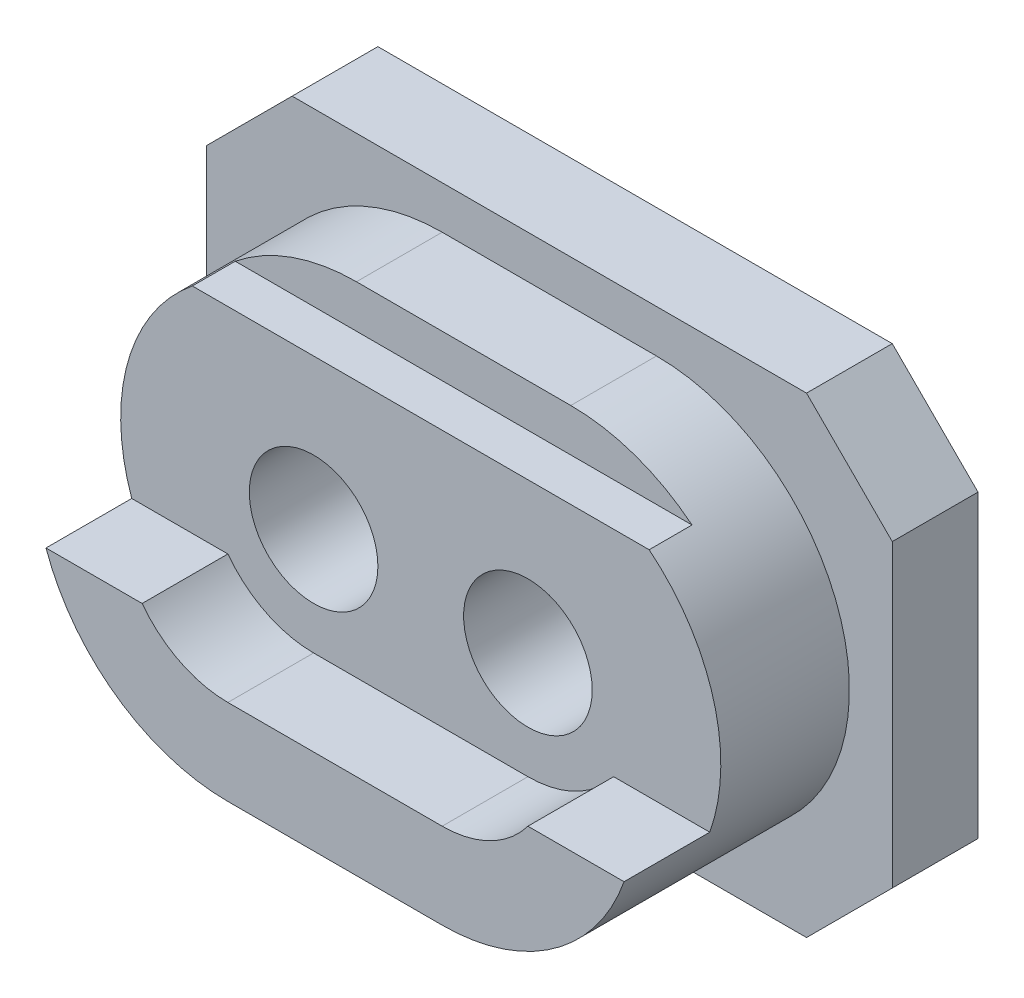
ISO-10303-21;
HEADER;
FILE_DESCRIPTION(('STEP AP214'),'2;1');
FILE_NAME('part.step','',(''),(''),'','','');
FILE_SCHEMA(('AUTOMOTIVE_DESIGN { 1 0 10303 214 1 1 1 1 }'));
ENDSEC;
DATA;
#1=APPLICATION_CONTEXT('core data for automotive mechanical design processes');
#2=APPLICATION_PROTOCOL_DEFINITION('international standard','automotive_design',2000,#1);
#3=PRODUCT_CONTEXT('',#1,'mechanical');
#4=PRODUCT('Part','Part','',(#3));
#5=PRODUCT_RELATED_PRODUCT_CATEGORY('part','',(#4));
#6=PRODUCT_DEFINITION_FORMATION('','',#4);
#7=PRODUCT_DEFINITION_CONTEXT('part definition',#1,'design');
#8=PRODUCT_DEFINITION('design','',#6,#7);
#9=PRODUCT_DEFINITION_SHAPE('','',#8);
#10=(LENGTH_UNIT() NAMED_UNIT(*) SI_UNIT(.MILLI.,.METRE.));
#11=(NAMED_UNIT(*) PLANE_ANGLE_UNIT() SI_UNIT($,.RADIAN.));
#12=(NAMED_UNIT(*) SI_UNIT($,.STERADIAN.) SOLID_ANGLE_UNIT());
#13=UNCERTAINTY_MEASURE_WITH_UNIT(LENGTH_MEASURE(1.E-05),#10,'distance_accuracy_value','');
#14=(GEOMETRIC_REPRESENTATION_CONTEXT(3) GLOBAL_UNCERTAINTY_ASSIGNED_CONTEXT((#13)) GLOBAL_UNIT_ASSIGNED_CONTEXT((#10,
#11,#12)) REPRESENTATION_CONTEXT('',''));
#15=CARTESIAN_POINT('',(0.,0.,0.));
#16=DIRECTION('',(0.,0.,1.));
#17=DIRECTION('',(1.,0.,0.));
#18=AXIS2_PLACEMENT_3D('',#15,#16,#17);
#19=CARTESIAN_POINT('',(-2.5,0.,2.));
#20=DIRECTION('',(0.,0.,-1.));
#21=DIRECTION('',(-1.,0.,0.));
#22=AXIS2_PLACEMENT_3D('',#19,#20,#21);
#23=CYLINDRICAL_SURFACE('',#22,1.5);
#24=CARTESIAN_POINT('',(-2.5,0.,0.));
#25=DIRECTION('',(0.,0.,1.));
#26=DIRECTION('',(1.,0.,0.));
#27=AXIS2_PLACEMENT_3D('',#24,#25,#26);
#28=CIRCLE('',#27,1.5);
#29=CARTESIAN_POINT('',(-1.,0.,0.));
#30=VERTEX_POINT('',#29);
#31=EDGE_CURVE('E269',#30,#30,#28,.T.);
#32=ORIENTED_EDGE('',*,*,#31,.F.);
#33=EDGE_LOOP('',(#32));
#34=FACE_BOUND('',#33,.T.);
#35=CARTESIAN_POINT('',(-2.5,0.,5.));
#36=DIRECTION('',(0.,0.,1.));
#37=DIRECTION('',(1.,0.,0.));
#38=AXIS2_PLACEMENT_3D('',#35,#36,#37);
#39=CIRCLE('',#38,1.5);
#40=CARTESIAN_POINT('',(-1.,0.,5.));
#41=VERTEX_POINT('',#40);
#42=EDGE_CURVE('E238',#41,#41,#39,.T.);
#43=ORIENTED_EDGE('',*,*,#42,.T.);
#44=EDGE_LOOP('',(#43));
#45=FACE_BOUND('',#44,.T.);
#46=ADVANCED_FACE('F33',(#34,#45),#23,.F.);
#47=CARTESIAN_POINT('',(2.5,0.,2.));
#48=DIRECTION('',(0.,0.,-1.));
#49=DIRECTION('',(-1.,0.,0.));
#50=AXIS2_PLACEMENT_3D('',#47,#48,#49);
#51=CYLINDRICAL_SURFACE('',#50,1.5);
#52=CARTESIAN_POINT('',(2.5,0.,0.));
#53=DIRECTION('',(0.,0.,1.));
#54=DIRECTION('',(1.,0.,0.));
#55=AXIS2_PLACEMENT_3D('',#52,#53,#54);
#56=CIRCLE('',#55,1.5);
#57=CARTESIAN_POINT('',(4.,0.,0.));
#58=VERTEX_POINT('',#57);
#59=EDGE_CURVE('E266',#58,#58,#56,.T.);
#60=ORIENTED_EDGE('',*,*,#59,.F.);
#61=EDGE_LOOP('',(#60));
#62=FACE_BOUND('',#61,.T.);
#63=CARTESIAN_POINT('',(2.5,0.,5.));
#64=DIRECTION('',(0.,0.,1.));
#65=DIRECTION('',(1.,0.,0.));
#66=AXIS2_PLACEMENT_3D('',#63,#64,#65);
#67=CIRCLE('',#66,1.5);
#68=CARTESIAN_POINT('',(4.,0.,5.));
#69=VERTEX_POINT('',#68);
#70=EDGE_CURVE('E235',#69,#69,#67,.T.);
#71=ORIENTED_EDGE('',*,*,#70,.T.);
#72=EDGE_LOOP('',(#71));
#73=FACE_BOUND('',#72,.T.);
#74=ADVANCED_FACE('F377',(#62,#73),#51,.F.);
#75=CARTESIAN_POINT('',(0.,0.,2.));
#76=DIRECTION('',(0.,0.,-1.));
#77=DIRECTION('',(-1.,0.,0.));
#78=AXIS2_PLACEMENT_3D('',#75,#76,#77);
#79=PLANE('',#78);
#80=DIRECTION('',(0.,-1.,0.));
#81=VECTOR('',#80,1.);
#82=CARTESIAN_POINT('',(-8.,-3.5,2.));
#83=LINE('',#82,#81);
#84=CARTESIAN_POINT('',(-8.,3.5,2.));
#85=VERTEX_POINT('',#84);
#86=CARTESIAN_POINT('',(-8.,-3.5,2.));
#87=VERTEX_POINT('',#86);
#88=EDGE_CURVE('E273',#85,#87,#83,.T.);
#89=ORIENTED_EDGE('',*,*,#88,.T.);
#90=DIRECTION('',(0.707106781186548,-0.707106781186548,0.));
#91=VECTOR('',#90,1.);
#92=CARTESIAN_POINT('',(-8.,-3.5,2.));
#93=LINE('',#92,#91);
#94=CARTESIAN_POINT('',(-6.,-5.5,2.));
#95=VERTEX_POINT('',#94);
#96=EDGE_CURVE('E276',#87,#95,#93,.T.);
#97=ORIENTED_EDGE('',*,*,#96,.T.);
#98=DIRECTION('',(1.,0.,0.));
#99=VECTOR('',#98,1.);
#100=CARTESIAN_POINT('',(-6.,-5.5,2.));
#101=LINE('',#100,#99);
#102=CARTESIAN_POINT('',(6.,-5.5,2.));
#103=VERTEX_POINT('',#102);
#104=EDGE_CURVE('E279',#95,#103,#101,.T.);
#105=ORIENTED_EDGE('',*,*,#104,.T.);
#106=DIRECTION('',(0.707106781186548,0.707106781186548,0.));
#107=VECTOR('',#106,1.);
#108=CARTESIAN_POINT('',(6.,-5.5,2.));
#109=LINE('',#108,#107);
#110=CARTESIAN_POINT('',(8.,-3.5,2.));
#111=VERTEX_POINT('',#110);
#112=EDGE_CURVE('E281',#103,#111,#109,.T.);
#113=ORIENTED_EDGE('',*,*,#112,.T.);
#114=DIRECTION('',(0.,1.,0.));
#115=VECTOR('',#114,1.);
#116=CARTESIAN_POINT('',(8.,-3.5,2.));
#117=LINE('',#116,#115);
#118=CARTESIAN_POINT('',(8.,3.5,2.));
#119=VERTEX_POINT('',#118);
#120=EDGE_CURVE('E283',#111,#119,#117,.T.);
#121=ORIENTED_EDGE('',*,*,#120,.T.);
#122=DIRECTION('',(-0.707106781186548,0.707106781186548,0.));
#123=VECTOR('',#122,1.);
#124=CARTESIAN_POINT('',(6.,5.5,2.));
#125=LINE('',#124,#123);
#126=CARTESIAN_POINT('',(6.,5.5,2.));
#127=VERTEX_POINT('',#126);
#128=EDGE_CURVE('E285',#119,#127,#125,.T.);
#129=ORIENTED_EDGE('',*,*,#128,.T.);
#130=DIRECTION('',(-1.,0.,0.));
#131=VECTOR('',#130,1.);
#132=CARTESIAN_POINT('',(-6.,5.5,2.));
#133=LINE('',#132,#131);
#134=CARTESIAN_POINT('',(-6.,5.5,2.));
#135=VERTEX_POINT('',#134);
#136=EDGE_CURVE('E287',#127,#135,#133,.T.);
#137=ORIENTED_EDGE('',*,*,#136,.T.);
#138=DIRECTION('',(-0.707106781186548,-0.707106781186548,0.));
#139=VECTOR('',#138,1.);
#140=CARTESIAN_POINT('',(-8.,3.5,2.));
#141=LINE('',#140,#139);
#142=EDGE_CURVE('E289',#135,#85,#141,.T.);
#143=ORIENTED_EDGE('',*,*,#142,.T.);
#144=EDGE_LOOP('',(#89,#97,#105,#113,#121,#129,#137,#143));
#145=FACE_BOUND('',#144,.T.);
#146=CARTESIAN_POINT('',(-2.5,0.,2.));
#147=DIRECTION('',(0.,0.,1.));
#148=DIRECTION('',(1.,0.,0.));
#149=AXIS2_PLACEMENT_3D('',#146,#147,#148);
#150=CIRCLE('',#149,4.5);
#151=CARTESIAN_POINT('',(-2.5,4.5,2.));
#152=VERTEX_POINT('',#151);
#153=CARTESIAN_POINT('',(-2.5,-4.5,2.));
#154=VERTEX_POINT('',#153);
#155=EDGE_CURVE('E241',#152,#154,#150,.T.);
#156=ORIENTED_EDGE('',*,*,#155,.F.);
#157=DIRECTION('',(-1.,0.,0.));
#158=VECTOR('',#157,1.);
#159=CARTESIAN_POINT('',(-2.5,4.5,2.));
#160=LINE('',#159,#158);
#161=CARTESIAN_POINT('',(2.5,4.5,2.));
#162=VERTEX_POINT('',#161);
#163=EDGE_CURVE('E245',#162,#152,#160,.T.);
#164=ORIENTED_EDGE('',*,*,#163,.F.);
#165=CARTESIAN_POINT('',(2.5,0.,2.));
#166=DIRECTION('',(0.,0.,1.));
#167=DIRECTION('',(1.,0.,0.));
#168=AXIS2_PLACEMENT_3D('',#165,#166,#167);
#169=CIRCLE('',#168,4.5);
#170=CARTESIAN_POINT('',(2.5,-4.5,2.));
#171=VERTEX_POINT('',#170);
#172=EDGE_CURVE('E254',#171,#162,#169,.T.);
#173=ORIENTED_EDGE('',*,*,#172,.F.);
#174=DIRECTION('',(1.,0.,0.));
#175=VECTOR('',#174,1.);
#176=CARTESIAN_POINT('',(-2.5,-4.5,2.));
#177=LINE('',#176,#175);
#178=EDGE_CURVE('E251',#154,#171,#177,.T.);
#179=ORIENTED_EDGE('',*,*,#178,.F.);
#180=EDGE_LOOP('',(#156,#164,#173,#179));
#181=FACE_BOUND('',#180,.T.);
#182=ADVANCED_FACE('F363',(#145,#181),#79,.F.);
#183=CARTESIAN_POINT('',(0.,0.,0.));
#184=DIRECTION('',(0.,0.,-1.));
#185=DIRECTION('',(-1.,0.,0.));
#186=AXIS2_PLACEMENT_3D('',#183,#184,#185);
#187=PLANE('',#186);
#188=ORIENTED_EDGE('',*,*,#31,.T.);
#189=EDGE_LOOP('',(#188));
#190=FACE_BOUND('',#189,.T.);
#191=DIRECTION('',(0.,-1.,0.));
#192=VECTOR('',#191,1.);
#193=CARTESIAN_POINT('',(-8.,-3.5,0.));
#194=LINE('',#193,#192);
#195=CARTESIAN_POINT('',(-8.,3.5,0.));
#196=VERTEX_POINT('',#195);
#197=CARTESIAN_POINT('',(-8.,-3.5,0.));
#198=VERTEX_POINT('',#197);
#199=EDGE_CURVE('E272',#196,#198,#194,.T.);
#200=ORIENTED_EDGE('',*,*,#199,.F.);
#201=DIRECTION('',(-0.707106781186548,-0.707106781186548,0.));
#202=VECTOR('',#201,1.);
#203=CARTESIAN_POINT('',(-8.,3.5,0.));
#204=LINE('',#203,#202);
#205=CARTESIAN_POINT('',(-6.,5.5,0.));
#206=VERTEX_POINT('',#205);
#207=EDGE_CURVE('E277',#206,#196,#204,.T.);
#208=ORIENTED_EDGE('',*,*,#207,.F.);
#209=DIRECTION('',(-1.,0.,0.));
#210=VECTOR('',#209,1.);
#211=CARTESIAN_POINT('',(-6.,5.5,0.));
#212=LINE('',#211,#210);
#213=CARTESIAN_POINT('',(6.,5.5,0.));
#214=VERTEX_POINT('',#213);
#215=EDGE_CURVE('E304',#214,#206,#212,.T.);
#216=ORIENTED_EDGE('',*,*,#215,.F.);
#217=DIRECTION('',(-0.707106781186548,0.707106781186548,0.));
#218=VECTOR('',#217,1.);
#219=CARTESIAN_POINT('',(6.,5.5,0.));
#220=LINE('',#219,#218);
#221=CARTESIAN_POINT('',(8.,3.5,0.));
#222=VERTEX_POINT('',#221);
#223=EDGE_CURVE('E302',#222,#214,#220,.T.);
#224=ORIENTED_EDGE('',*,*,#223,.F.);
#225=DIRECTION('',(0.,1.,0.));
#226=VECTOR('',#225,1.);
#227=CARTESIAN_POINT('',(8.,-3.5,0.));
#228=LINE('',#227,#226);
#229=CARTESIAN_POINT('',(8.,-3.5,0.));
#230=VERTEX_POINT('',#229);
#231=EDGE_CURVE('E300',#230,#222,#228,.T.);
#232=ORIENTED_EDGE('',*,*,#231,.F.);
#233=DIRECTION('',(0.707106781186548,0.707106781186548,0.));
#234=VECTOR('',#233,1.);
#235=CARTESIAN_POINT('',(6.,-5.5,0.));
#236=LINE('',#235,#234);
#237=CARTESIAN_POINT('',(6.,-5.5,0.));
#238=VERTEX_POINT('',#237);
#239=EDGE_CURVE('E298',#238,#230,#236,.T.);
#240=ORIENTED_EDGE('',*,*,#239,.F.);
#241=DIRECTION('',(1.,0.,0.));
#242=VECTOR('',#241,1.);
#243=CARTESIAN_POINT('',(-6.,-5.5,0.));
#244=LINE('',#243,#242);
#245=CARTESIAN_POINT('',(-6.,-5.5,0.));
#246=VERTEX_POINT('',#245);
#247=EDGE_CURVE('E296',#246,#238,#244,.T.);
#248=ORIENTED_EDGE('',*,*,#247,.F.);
#249=DIRECTION('',(0.707106781186548,-0.707106781186548,0.));
#250=VECTOR('',#249,1.);
#251=CARTESIAN_POINT('',(-8.,-3.5,0.));
#252=LINE('',#251,#250);
#253=EDGE_CURVE('E294',#198,#246,#252,.T.);
#254=ORIENTED_EDGE('',*,*,#253,.F.);
#255=EDGE_LOOP('',(#200,#208,#216,#224,#232,#240,#248,#254));
#256=FACE_BOUND('',#255,.T.);
#257=ORIENTED_EDGE('',*,*,#59,.T.);
#258=EDGE_LOOP('',(#257));
#259=FACE_BOUND('',#258,.T.);
#260=ADVANCED_FACE('F391',(#190,#256,#259),#187,.T.);
#261=CARTESIAN_POINT('',(-8.,-3.5,2.));
#262=DIRECTION('',(1.,0.,0.));
#263=DIRECTION('',(0.,0.,-1.));
#264=AXIS2_PLACEMENT_3D('',#261,#262,#263);
#265=PLANE('',#264);
#266=ORIENTED_EDGE('',*,*,#199,.T.);
#267=DIRECTION('',(0.,0.,-1.));
#268=VECTOR('',#267,1.);
#269=CARTESIAN_POINT('',(-8.,-3.5,2.));
#270=LINE('',#269,#268);
#271=EDGE_CURVE('E327',#87,#198,#270,.T.);
#272=ORIENTED_EDGE('',*,*,#271,.F.);
#273=ORIENTED_EDGE('',*,*,#88,.F.);
#274=DIRECTION('',(0.,0.,-1.));
#275=VECTOR('',#274,1.);
#276=CARTESIAN_POINT('',(-8.,3.5,2.));
#277=LINE('',#276,#275);
#278=EDGE_CURVE('E291',#85,#196,#277,.T.);
#279=ORIENTED_EDGE('',*,*,#278,.T.);
#280=EDGE_LOOP('',(#266,#272,#273,#279));
#281=FACE_BOUND('',#280,.T.);
#282=ADVANCED_FACE('F35',(#281),#265,.F.);
#283=CARTESIAN_POINT('',(-8.,-3.5,2.));
#284=DIRECTION('',(0.707106781186547,0.707106781186547,0.));
#285=DIRECTION('',(-0.707106781186548,0.707106781186548,0.));
#286=AXIS2_PLACEMENT_3D('',#283,#284,#285);
#287=PLANE('',#286);
#288=ORIENTED_EDGE('',*,*,#253,.T.);
#289=DIRECTION('',(0.,0.,-1.));
#290=VECTOR('',#289,1.);
#291=CARTESIAN_POINT('',(-6.,-5.5,2.));
#292=LINE('',#291,#290);
#293=EDGE_CURVE('E324',#95,#246,#292,.T.);
#294=ORIENTED_EDGE('',*,*,#293,.F.);
#295=ORIENTED_EDGE('',*,*,#96,.F.);
#296=ORIENTED_EDGE('',*,*,#271,.T.);
#297=EDGE_LOOP('',(#288,#294,#295,#296));
#298=FACE_BOUND('',#297,.T.);
#299=ADVANCED_FACE('F418',(#298),#287,.F.);
#300=CARTESIAN_POINT('',(-6.,-5.5,2.));
#301=DIRECTION('',(0.,1.,0.));
#302=DIRECTION('',(0.,0.,1.));
#303=AXIS2_PLACEMENT_3D('',#300,#301,#302);
#304=PLANE('',#303);
#305=ORIENTED_EDGE('',*,*,#247,.T.);
#306=DIRECTION('',(0.,0.,-1.));
#307=VECTOR('',#306,1.);
#308=CARTESIAN_POINT('',(6.,-5.5,2.));
#309=LINE('',#308,#307);
#310=EDGE_CURVE('E321',#103,#238,#309,.T.);
#311=ORIENTED_EDGE('',*,*,#310,.F.);
#312=ORIENTED_EDGE('',*,*,#104,.F.);
#313=ORIENTED_EDGE('',*,*,#293,.T.);
#314=EDGE_LOOP('',(#305,#311,#312,#313));
#315=FACE_BOUND('',#314,.T.);
#316=ADVANCED_FACE('F415',(#315),#304,.F.);
#317=CARTESIAN_POINT('',(6.,-5.5,2.));
#318=DIRECTION('',(-0.707106781186547,0.707106781186547,0.));
#319=DIRECTION('',(-0.707106781186548,-0.707106781186548,0.));
#320=AXIS2_PLACEMENT_3D('',#317,#318,#319);
#321=PLANE('',#320);
#322=ORIENTED_EDGE('',*,*,#239,.T.);
#323=DIRECTION('',(0.,0.,-1.));
#324=VECTOR('',#323,1.);
#325=CARTESIAN_POINT('',(8.,-3.5,2.));
#326=LINE('',#325,#324);
#327=EDGE_CURVE('E318',#111,#230,#326,.T.);
#328=ORIENTED_EDGE('',*,*,#327,.F.);
#329=ORIENTED_EDGE('',*,*,#112,.F.);
#330=ORIENTED_EDGE('',*,*,#310,.T.);
#331=EDGE_LOOP('',(#322,#328,#329,#330));
#332=FACE_BOUND('',#331,.T.);
#333=ADVANCED_FACE('F411',(#332),#321,.F.);
#334=CARTESIAN_POINT('',(8.,-3.5,2.));
#335=DIRECTION('',(-1.,0.,0.));
#336=DIRECTION('',(0.,0.,1.));
#337=AXIS2_PLACEMENT_3D('',#334,#335,#336);
#338=PLANE('',#337);
#339=ORIENTED_EDGE('',*,*,#231,.T.);
#340=DIRECTION('',(0.,0.,-1.));
#341=VECTOR('',#340,1.);
#342=CARTESIAN_POINT('',(8.,3.5,2.));
#343=LINE('',#342,#341);
#344=EDGE_CURVE('E315',#119,#222,#343,.T.);
#345=ORIENTED_EDGE('',*,*,#344,.F.);
#346=ORIENTED_EDGE('',*,*,#120,.F.);
#347=ORIENTED_EDGE('',*,*,#327,.T.);
#348=EDGE_LOOP('',(#339,#345,#346,#347));
#349=FACE_BOUND('',#348,.T.);
#350=ADVANCED_FACE('F407',(#349),#338,.F.);
#351=CARTESIAN_POINT('',(6.,5.5,2.));
#352=DIRECTION('',(-0.707106781186547,-0.707106781186547,0.));
#353=DIRECTION('',(0.707106781186548,-0.707106781186548,0.));
#354=AXIS2_PLACEMENT_3D('',#351,#352,#353);
#355=PLANE('',#354);
#356=ORIENTED_EDGE('',*,*,#223,.T.);
#357=DIRECTION('',(0.,0.,-1.));
#358=VECTOR('',#357,1.);
#359=CARTESIAN_POINT('',(6.,5.5,2.));
#360=LINE('',#359,#358);
#361=EDGE_CURVE('E312',#127,#214,#360,.T.);
#362=ORIENTED_EDGE('',*,*,#361,.F.);
#363=ORIENTED_EDGE('',*,*,#128,.F.);
#364=ORIENTED_EDGE('',*,*,#344,.T.);
#365=EDGE_LOOP('',(#356,#362,#363,#364));
#366=FACE_BOUND('',#365,.T.);
#367=ADVANCED_FACE('F403',(#366),#355,.F.);
#368=CARTESIAN_POINT('',(-6.,5.5,2.));
#369=DIRECTION('',(0.,-1.,0.));
#370=DIRECTION('',(0.,0.,-1.));
#371=AXIS2_PLACEMENT_3D('',#368,#369,#370);
#372=PLANE('',#371);
#373=ORIENTED_EDGE('',*,*,#215,.T.);
#374=DIRECTION('',(0.,0.,-1.));
#375=VECTOR('',#374,1.);
#376=CARTESIAN_POINT('',(-6.,5.5,2.));
#377=LINE('',#376,#375);
#378=EDGE_CURVE('E309',#135,#206,#377,.T.);
#379=ORIENTED_EDGE('',*,*,#378,.F.);
#380=ORIENTED_EDGE('',*,*,#136,.F.);
#381=ORIENTED_EDGE('',*,*,#361,.T.);
#382=EDGE_LOOP('',(#373,#379,#380,#381));
#383=FACE_BOUND('',#382,.T.);
#384=ADVANCED_FACE('F399',(#383),#372,.F.);
#385=CARTESIAN_POINT('',(-8.,3.5,2.));
#386=DIRECTION('',(0.707106781186547,-0.707106781186547,0.));
#387=DIRECTION('',(0.707106781186548,0.707106781186548,0.));
#388=AXIS2_PLACEMENT_3D('',#385,#386,#387);
#389=PLANE('',#388);
#390=ORIENTED_EDGE('',*,*,#207,.T.);
#391=ORIENTED_EDGE('',*,*,#278,.F.);
#392=ORIENTED_EDGE('',*,*,#142,.F.);
#393=ORIENTED_EDGE('',*,*,#378,.T.);
#394=EDGE_LOOP('',(#390,#391,#392,#393));
#395=FACE_BOUND('',#394,.T.);
#396=ADVANCED_FACE('F396',(#395),#389,.F.);
#397=CARTESIAN_POINT('',(-2.5,0.,7.));
#398=DIRECTION('',(0.,0.,1.));
#399=DIRECTION('',(1.,0.,0.));
#400=AXIS2_PLACEMENT_3D('',#397,#398,#399);
#401=PLANE('',#400);
#402=DIRECTION('',(1.,0.,0.));
#403=VECTOR('',#402,1.);
#404=CARTESIAN_POINT('',(-4.5,-1.5,7.));
#405=LINE('',#404,#403);
#406=CARTESIAN_POINT('',(-6.74264068711928,-1.5,7.));
#407=VERTEX_POINT('',#406);
#408=CARTESIAN_POINT('',(-4.5,-1.5,7.));
#409=VERTEX_POINT('',#408);
#410=EDGE_CURVE('E204',#407,#409,#405,.T.);
#411=ORIENTED_EDGE('',*,*,#410,.F.);
#412=CARTESIAN_POINT('',(-2.5,0.,7.));
#413=DIRECTION('',(0.,0.,1.));
#414=DIRECTION('',(1.,0.,0.));
#415=AXIS2_PLACEMENT_3D('',#412,#413,#414);
#416=CIRCLE('',#415,4.5);
#417=CARTESIAN_POINT('',(-2.5,-4.5,7.));
#418=VERTEX_POINT('',#417);
#419=EDGE_CURVE('E242',#407,#418,#416,.T.);
#420=ORIENTED_EDGE('',*,*,#419,.T.);
#421=DIRECTION('',(1.,0.,0.));
#422=VECTOR('',#421,1.);
#423=CARTESIAN_POINT('',(-2.5,-4.5,7.));
#424=LINE('',#423,#422);
#425=CARTESIAN_POINT('',(2.5,-4.5,7.));
#426=VERTEX_POINT('',#425);
#427=EDGE_CURVE('E244',#418,#426,#424,.T.);
#428=ORIENTED_EDGE('',*,*,#427,.T.);
#429=CARTESIAN_POINT('',(2.5,0.,7.));
#430=DIRECTION('',(0.,0.,1.));
#431=DIRECTION('',(1.,0.,0.));
#432=AXIS2_PLACEMENT_3D('',#429,#430,#431);
#433=CIRCLE('',#432,4.5);
#434=CARTESIAN_POINT('',(6.74264068711928,-1.5,7.));
#435=VERTEX_POINT('',#434);
#436=EDGE_CURVE('E247',#426,#435,#433,.T.);
#437=ORIENTED_EDGE('',*,*,#436,.T.);
#438=DIRECTION('',(1.,0.,0.));
#439=VECTOR('',#438,1.);
#440=CARTESIAN_POINT('',(4.5,-1.5,7.));
#441=LINE('',#440,#439);
#442=CARTESIAN_POINT('',(4.5,-1.5,7.));
#443=VERTEX_POINT('',#442);
#444=EDGE_CURVE('E222',#443,#435,#441,.T.);
#445=ORIENTED_EDGE('',*,*,#444,.F.);
#446=CARTESIAN_POINT('',(2.5,0.,7.));
#447=DIRECTION('',(0.,0.,1.));
#448=DIRECTION('',(1.,0.,0.));
#449=AXIS2_PLACEMENT_3D('',#446,#447,#448);
#450=CIRCLE('',#449,2.5);
#451=CARTESIAN_POINT('',(2.5,-2.5,7.));
#452=VERTEX_POINT('',#451);
#453=EDGE_CURVE('E219',#452,#443,#450,.T.);
#454=ORIENTED_EDGE('',*,*,#453,.F.);
#455=DIRECTION('',(1.,0.,0.));
#456=VECTOR('',#455,1.);
#457=CARTESIAN_POINT('',(-2.5,-2.5,7.));
#458=LINE('',#457,#456);
#459=CARTESIAN_POINT('',(-2.5,-2.5,7.));
#460=VERTEX_POINT('',#459);
#461=EDGE_CURVE('E216',#460,#452,#458,.T.);
#462=ORIENTED_EDGE('',*,*,#461,.F.);
#463=CARTESIAN_POINT('',(-2.5,0.,7.));
#464=DIRECTION('',(0.,0.,1.));
#465=DIRECTION('',(1.,0.,0.));
#466=AXIS2_PLACEMENT_3D('',#463,#464,#465);
#467=CIRCLE('',#466,2.5);
#468=EDGE_CURVE('E196',#409,#460,#467,.T.);
#469=ORIENTED_EDGE('',*,*,#468,.F.);
#470=EDGE_LOOP('',(#411,#420,#428,#437,#445,#454,#462,#469));
#471=FACE_BOUND('',#470,.T.);
#472=ADVANCED_FACE('F346',(#471),#401,.T.);
#473=CARTESIAN_POINT('',(-2.5,0.,7.));
#474=DIRECTION('',(0.,0.,-1.));
#475=DIRECTION('',(-1.,0.,0.));
#476=AXIS2_PLACEMENT_3D('',#473,#474,#475);
#477=CYLINDRICAL_SURFACE('',#476,4.5);
#478=CARTESIAN_POINT('',(-2.5,0.,5.));
#479=DIRECTION('',(0.,0.,1.));
#480=DIRECTION('',(1.,0.,0.));
#481=AXIS2_PLACEMENT_3D('',#478,#479,#480);
#482=CIRCLE('',#481,4.5);
#483=CARTESIAN_POINT('',(-5.32842712474619,3.5,5.));
#484=VERTEX_POINT('',#483);
#485=CARTESIAN_POINT('',(-6.74264068711928,-1.5,5.));
#486=VERTEX_POINT('',#485);
#487=EDGE_CURVE('E228',#484,#486,#482,.T.);
#488=ORIENTED_EDGE('',*,*,#487,.F.);
#489=DIRECTION('',(0.,0.,-1.));
#490=VECTOR('',#489,1.);
#491=CARTESIAN_POINT('',(-5.32842712474619,3.5,7.));
#492=LINE('',#491,#490);
#493=CARTESIAN_POINT('',(-5.32842712474619,3.5,4.));
#494=VERTEX_POINT('',#493);
#495=EDGE_CURVE('E185',#484,#494,#492,.T.);
#496=ORIENTED_EDGE('',*,*,#495,.T.);
#497=CARTESIAN_POINT('',(-2.5,0.,4.));
#498=DIRECTION('',(0.,0.,-1.));
#499=DIRECTION('',(-1.,0.,0.));
#500=AXIS2_PLACEMENT_3D('',#497,#498,#499);
#501=CIRCLE('',#500,4.5);
#502=CARTESIAN_POINT('',(-2.5,4.5,4.));
#503=VERTEX_POINT('',#502);
#504=EDGE_CURVE('E189',#494,#503,#501,.T.);
#505=ORIENTED_EDGE('',*,*,#504,.T.);
#506=DIRECTION('',(0.,0.,-1.));
#507=VECTOR('',#506,1.);
#508=CARTESIAN_POINT('',(-2.5,4.5,7.));
#509=LINE('',#508,#507);
#510=EDGE_CURVE('E56',#503,#152,#509,.T.);
#511=ORIENTED_EDGE('',*,*,#510,.T.);
#512=ORIENTED_EDGE('',*,*,#155,.T.);
#513=DIRECTION('',(0.,0.,-1.));
#514=VECTOR('',#513,1.);
#515=CARTESIAN_POINT('',(-2.5,-4.5,7.));
#516=LINE('',#515,#514);
#517=EDGE_CURVE('E263',#418,#154,#516,.T.);
#518=ORIENTED_EDGE('',*,*,#517,.F.);
#519=ORIENTED_EDGE('',*,*,#419,.F.);
#520=DIRECTION('',(0.,0.,-1.));
#521=VECTOR('',#520,1.);
#522=CARTESIAN_POINT('',(-6.74264068711928,-1.5,7.));
#523=LINE('',#522,#521);
#524=EDGE_CURVE('E41',#407,#486,#523,.T.);
#525=ORIENTED_EDGE('',*,*,#524,.T.);
#526=EDGE_LOOP('',(#488,#496,#505,#511,#512,#518,#519,#525));
#527=FACE_BOUND('',#526,.T.);
#528=ADVANCED_FACE('F337',(#527),#477,.T.);
#529=CARTESIAN_POINT('',(-2.5,-4.5,7.));
#530=DIRECTION('',(0.,1.,0.));
#531=DIRECTION('',(0.,0.,1.));
#532=AXIS2_PLACEMENT_3D('',#529,#530,#531);
#533=PLANE('',#532);
#534=ORIENTED_EDGE('',*,*,#178,.T.);
#535=DIRECTION('',(0.,0.,-1.));
#536=VECTOR('',#535,1.);
#537=CARTESIAN_POINT('',(2.5,-4.5,7.));
#538=LINE('',#537,#536);
#539=EDGE_CURVE('E260',#426,#171,#538,.T.);
#540=ORIENTED_EDGE('',*,*,#539,.F.);
#541=ORIENTED_EDGE('',*,*,#427,.F.);
#542=ORIENTED_EDGE('',*,*,#517,.T.);
#543=EDGE_LOOP('',(#534,#540,#541,#542));
#544=FACE_BOUND('',#543,.T.);
#545=ADVANCED_FACE('F360',(#544),#533,.F.);
#546=CARTESIAN_POINT('',(2.5,0.,7.));
#547=DIRECTION('',(0.,0.,-1.));
#548=DIRECTION('',(-1.,0.,0.));
#549=AXIS2_PLACEMENT_3D('',#546,#547,#548);
#550=CYLINDRICAL_SURFACE('',#549,4.5);
#551=CARTESIAN_POINT('',(2.5,0.,4.));
#552=DIRECTION('',(0.,0.,-1.));
#553=DIRECTION('',(-1.,0.,0.));
#554=AXIS2_PLACEMENT_3D('',#551,#552,#553);
#555=CIRCLE('',#554,4.5);
#556=CARTESIAN_POINT('',(2.5,4.5,4.));
#557=VERTEX_POINT('',#556);
#558=CARTESIAN_POINT('',(5.32842712474619,3.5,4.));
#559=VERTEX_POINT('',#558);
#560=EDGE_CURVE('E184',#557,#559,#555,.T.);
#561=ORIENTED_EDGE('',*,*,#560,.T.);
#562=DIRECTION('',(0.,0.,-1.));
#563=VECTOR('',#562,1.);
#564=CARTESIAN_POINT('',(5.32842712474619,3.5,7.));
#565=LINE('',#564,#563);
#566=CARTESIAN_POINT('',(5.32842712474619,3.5,5.));
#567=VERTEX_POINT('',#566);
#568=EDGE_CURVE('E174',#559,#567,#565,.F.);
#569=ORIENTED_EDGE('',*,*,#568,.T.);
#570=CARTESIAN_POINT('',(2.5,0.,5.));
#571=DIRECTION('',(0.,0.,1.));
#572=DIRECTION('',(1.,0.,0.));
#573=AXIS2_PLACEMENT_3D('',#570,#571,#572);
#574=CIRCLE('',#573,4.5);
#575=CARTESIAN_POINT('',(6.74264068711928,-1.5,5.));
#576=VERTEX_POINT('',#575);
#577=EDGE_CURVE('E330',#576,#567,#574,.T.);
#578=ORIENTED_EDGE('',*,*,#577,.F.);
#579=DIRECTION('',(0.,0.,-1.));
#580=VECTOR('',#579,1.);
#581=CARTESIAN_POINT('',(6.74264068711928,-1.5,7.));
#582=LINE('',#581,#580);
#583=EDGE_CURVE('E332',#576,#435,#582,.F.);
#584=ORIENTED_EDGE('',*,*,#583,.T.);
#585=ORIENTED_EDGE('',*,*,#436,.F.);
#586=ORIENTED_EDGE('',*,*,#539,.T.);
#587=ORIENTED_EDGE('',*,*,#172,.T.);
#588=DIRECTION('',(0.,0.,-1.));
#589=VECTOR('',#588,1.);
#590=CARTESIAN_POINT('',(2.5,4.5,7.));
#591=LINE('',#590,#589);
#592=EDGE_CURVE('E194',#557,#162,#591,.T.);
#593=ORIENTED_EDGE('',*,*,#592,.F.);
#594=EDGE_LOOP('',(#561,#569,#578,#584,#585,#586,#587,#593));
#595=FACE_BOUND('',#594,.T.);
#596=ADVANCED_FACE('F192',(#595),#550,.T.);
#597=CARTESIAN_POINT('',(-2.5,4.5,7.));
#598=DIRECTION('',(0.,-1.,0.));
#599=DIRECTION('',(0.,0.,-1.));
#600=AXIS2_PLACEMENT_3D('',#597,#598,#599);
#601=PLANE('',#600);
#602=ORIENTED_EDGE('',*,*,#510,.F.);
#603=DIRECTION('',(1.,0.,0.));
#604=VECTOR('',#603,1.);
#605=CARTESIAN_POINT('',(-2.5,4.5,4.));
#606=LINE('',#605,#604);
#607=EDGE_CURVE('E11',#503,#557,#606,.T.);
#608=ORIENTED_EDGE('',*,*,#607,.T.);
#609=ORIENTED_EDGE('',*,*,#592,.T.);
#610=ORIENTED_EDGE('',*,*,#163,.T.);
#611=EDGE_LOOP('',(#602,#608,#609,#610));
#612=FACE_BOUND('',#611,.T.);
#613=ADVANCED_FACE('F365',(#612),#601,.F.);
#614=CARTESIAN_POINT('',(-4.5,-1.5,5.));
#615=DIRECTION('',(0.,-1.,0.));
#616=DIRECTION('',(0.,0.,-1.));
#617=AXIS2_PLACEMENT_3D('',#614,#615,#616);
#618=PLANE('',#617);
#619=ORIENTED_EDGE('',*,*,#410,.T.);
#620=DIRECTION('',(0.,0.,1.));
#621=VECTOR('',#620,1.);
#622=CARTESIAN_POINT('',(-4.5,-1.5,5.));
#623=LINE('',#622,#621);
#624=CARTESIAN_POINT('',(-4.5,-1.5,5.));
#625=VERTEX_POINT('',#624);
#626=EDGE_CURVE('E225',#625,#409,#623,.T.);
#627=ORIENTED_EDGE('',*,*,#626,.F.);
#628=DIRECTION('',(1.,0.,0.));
#629=VECTOR('',#628,1.);
#630=CARTESIAN_POINT('',(-4.5,-1.5,5.));
#631=LINE('',#630,#629);
#632=EDGE_CURVE('E211',#486,#625,#631,.T.);
#633=ORIENTED_EDGE('',*,*,#632,.F.);
#634=ORIENTED_EDGE('',*,*,#524,.F.);
#635=EDGE_LOOP('',(#619,#627,#633,#634));
#636=FACE_BOUND('',#635,.T.);
#637=ADVANCED_FACE('F342',(#636),#618,.F.);
#638=CARTESIAN_POINT('',(4.5,-1.5,5.));
#639=DIRECTION('',(0.,-1.,0.));
#640=DIRECTION('',(0.,0.,-1.));
#641=AXIS2_PLACEMENT_3D('',#638,#639,#640);
#642=PLANE('',#641);
#643=DIRECTION('',(1.,0.,0.));
#644=VECTOR('',#643,1.);
#645=CARTESIAN_POINT('',(4.5,-1.5,5.));
#646=LINE('',#645,#644);
#647=CARTESIAN_POINT('',(4.5,-1.5,5.));
#648=VERTEX_POINT('',#647);
#649=EDGE_CURVE('E48',#648,#576,#646,.T.);
#650=ORIENTED_EDGE('',*,*,#649,.F.);
#651=DIRECTION('',(0.,0.,1.));
#652=VECTOR('',#651,1.);
#653=CARTESIAN_POINT('',(4.5,-1.5,5.));
#654=LINE('',#653,#652);
#655=EDGE_CURVE('E229',#648,#443,#654,.T.);
#656=ORIENTED_EDGE('',*,*,#655,.T.);
#657=ORIENTED_EDGE('',*,*,#444,.T.);
#658=ORIENTED_EDGE('',*,*,#583,.F.);
#659=EDGE_LOOP('',(#650,#656,#657,#658));
#660=FACE_BOUND('',#659,.T.);
#661=ADVANCED_FACE('F372',(#660),#642,.F.);
#662=CARTESIAN_POINT('',(-2.5,0.,5.));
#663=DIRECTION('',(0.,0.,1.));
#664=DIRECTION('',(1.,0.,0.));
#665=AXIS2_PLACEMENT_3D('',#662,#663,#664);
#666=PLANE('',#665);
#667=ORIENTED_EDGE('',*,*,#42,.F.);
#668=EDGE_LOOP('',(#667));
#669=FACE_BOUND('',#668,.T.);
#670=ORIENTED_EDGE('',*,*,#70,.F.);
#671=EDGE_LOOP('',(#670));
#672=FACE_BOUND('',#671,.T.);
#673=ORIENTED_EDGE('',*,*,#487,.T.);
#674=ORIENTED_EDGE('',*,*,#632,.T.);
#675=CARTESIAN_POINT('',(-2.5,0.,5.));
#676=DIRECTION('',(0.,0.,1.));
#677=DIRECTION('',(1.,0.,0.));
#678=AXIS2_PLACEMENT_3D('',#675,#676,#677);
#679=CIRCLE('',#678,2.5);
#680=CARTESIAN_POINT('',(-2.5,-2.5,5.));
#681=VERTEX_POINT('',#680);
#682=EDGE_CURVE('E200',#625,#681,#679,.T.);
#683=ORIENTED_EDGE('',*,*,#682,.T.);
#684=DIRECTION('',(1.,0.,0.));
#685=VECTOR('',#684,1.);
#686=CARTESIAN_POINT('',(-2.5,-2.5,5.));
#687=LINE('',#686,#685);
#688=CARTESIAN_POINT('',(2.5,-2.5,5.));
#689=VERTEX_POINT('',#688);
#690=EDGE_CURVE('E203',#681,#689,#687,.T.);
#691=ORIENTED_EDGE('',*,*,#690,.T.);
#692=CARTESIAN_POINT('',(2.5,0.,5.));
#693=DIRECTION('',(0.,0.,1.));
#694=DIRECTION('',(1.,0.,0.));
#695=AXIS2_PLACEMENT_3D('',#692,#693,#694);
#696=CIRCLE('',#695,2.5);
#697=EDGE_CURVE('E207',#689,#648,#696,.T.);
#698=ORIENTED_EDGE('',*,*,#697,.T.);
#699=ORIENTED_EDGE('',*,*,#649,.T.);
#700=ORIENTED_EDGE('',*,*,#577,.T.);
#701=DIRECTION('',(-1.,0.,0.));
#702=VECTOR('',#701,1.);
#703=CARTESIAN_POINT('',(4.54012724225035,3.5,5.));
#704=LINE('',#703,#702);
#705=EDGE_CURVE('E180',#567,#484,#704,.T.);
#706=ORIENTED_EDGE('',*,*,#705,.T.);
#707=EDGE_LOOP('',(#673,#674,#683,#691,#698,#699,#700,#706));
#708=FACE_BOUND('',#707,.T.);
#709=ADVANCED_FACE('F354',(#669,#672,#708),#666,.T.);
#710=CARTESIAN_POINT('',(-2.5,0.,5.));
#711=DIRECTION('',(0.,0.,1.));
#712=DIRECTION('',(1.,0.,0.));
#713=AXIS2_PLACEMENT_3D('',#710,#711,#712);
#714=CYLINDRICAL_SURFACE('',#713,2.5);
#715=ORIENTED_EDGE('',*,*,#468,.T.);
#716=DIRECTION('',(0.,0.,1.));
#717=VECTOR('',#716,1.);
#718=CARTESIAN_POINT('',(-2.5,-2.5,5.));
#719=LINE('',#718,#717);
#720=EDGE_CURVE('E213',#681,#460,#719,.T.);
#721=ORIENTED_EDGE('',*,*,#720,.F.);
#722=ORIENTED_EDGE('',*,*,#682,.F.);
#723=ORIENTED_EDGE('',*,*,#626,.T.);
#724=EDGE_LOOP('',(#715,#721,#722,#723));
#725=FACE_BOUND('',#724,.T.);
#726=ADVANCED_FACE('F351',(#725),#714,.F.);
#727=CARTESIAN_POINT('',(2.5,0.,5.));
#728=DIRECTION('',(0.,0.,1.));
#729=DIRECTION('',(1.,0.,0.));
#730=AXIS2_PLACEMENT_3D('',#727,#728,#729);
#731=CYLINDRICAL_SURFACE('',#730,2.5);
#732=ORIENTED_EDGE('',*,*,#453,.T.);
#733=ORIENTED_EDGE('',*,*,#655,.F.);
#734=ORIENTED_EDGE('',*,*,#697,.F.);
#735=DIRECTION('',(0.,0.,1.));
#736=VECTOR('',#735,1.);
#737=CARTESIAN_POINT('',(2.5,-2.5,5.));
#738=LINE('',#737,#736);
#739=EDGE_CURVE('E231',#689,#452,#738,.T.);
#740=ORIENTED_EDGE('',*,*,#739,.T.);
#741=EDGE_LOOP('',(#732,#733,#734,#740));
#742=FACE_BOUND('',#741,.T.);
#743=ADVANCED_FACE('F461',(#742),#731,.F.);
#744=CARTESIAN_POINT('',(-2.5,-2.5,5.));
#745=DIRECTION('',(0.,-1.,0.));
#746=DIRECTION('',(0.,0.,-1.));
#747=AXIS2_PLACEMENT_3D('',#744,#745,#746);
#748=PLANE('',#747);
#749=ORIENTED_EDGE('',*,*,#461,.T.);
#750=ORIENTED_EDGE('',*,*,#739,.F.);
#751=ORIENTED_EDGE('',*,*,#690,.F.);
#752=ORIENTED_EDGE('',*,*,#720,.T.);
#753=EDGE_LOOP('',(#749,#750,#751,#752));
#754=FACE_BOUND('',#753,.T.);
#755=ADVANCED_FACE('F470',(#754),#748,.F.);
#756=CARTESIAN_POINT('',(14.,4.5,4.));
#757=DIRECTION('',(0.,0.,-1.));
#758=DIRECTION('',(-1.,0.,0.));
#759=AXIS2_PLACEMENT_3D('',#756,#757,#758);
#760=PLANE('',#759);
#761=DIRECTION('',(-1.,0.,0.));
#762=VECTOR('',#761,1.);
#763=CARTESIAN_POINT('',(14.,3.5,4.));
#764=LINE('',#763,#762);
#765=EDGE_CURVE('E177',#559,#494,#764,.T.);
#766=ORIENTED_EDGE('',*,*,#765,.F.);
#767=ORIENTED_EDGE('',*,*,#560,.F.);
#768=ORIENTED_EDGE('',*,*,#607,.F.);
#769=ORIENTED_EDGE('',*,*,#504,.F.);
#770=EDGE_LOOP('',(#766,#767,#768,#769));
#771=FACE_BOUND('',#770,.T.);
#772=ADVANCED_FACE('F188',(#771),#760,.F.);
#773=CARTESIAN_POINT('',(14.,3.5,7.));
#774=DIRECTION('',(0.,-1.,0.));
#775=DIRECTION('',(0.,0.,-1.));
#776=AXIS2_PLACEMENT_3D('',#773,#774,#775);
#777=PLANE('',#776);
#778=ORIENTED_EDGE('',*,*,#765,.T.);
#779=ORIENTED_EDGE('',*,*,#495,.F.);
#780=ORIENTED_EDGE('',*,*,#705,.F.);
#781=ORIENTED_EDGE('',*,*,#568,.F.);
#782=EDGE_LOOP('',(#778,#779,#780,#781));
#783=FACE_BOUND('',#782,.T.);
#784=ADVANCED_FACE('F176',(#783),#777,.F.);
#785=CLOSED_SHELL('',(#46,#74,#182,#260,#282,#299,#316,#333,#350,#367,#384,#396,#472,#528,#545,
#596,#613,#637,#661,#709,#726,#743,#755,#772,#784));
#786=MANIFOLD_SOLID_BREP('B2',#785);
#787=ADVANCED_BREP_SHAPE_REPRESENTATION('',(#18,#786),#14);
#788=SHAPE_DEFINITION_REPRESENTATION(#9,#787);
ENDSEC;
END-ISO-10303-21;
